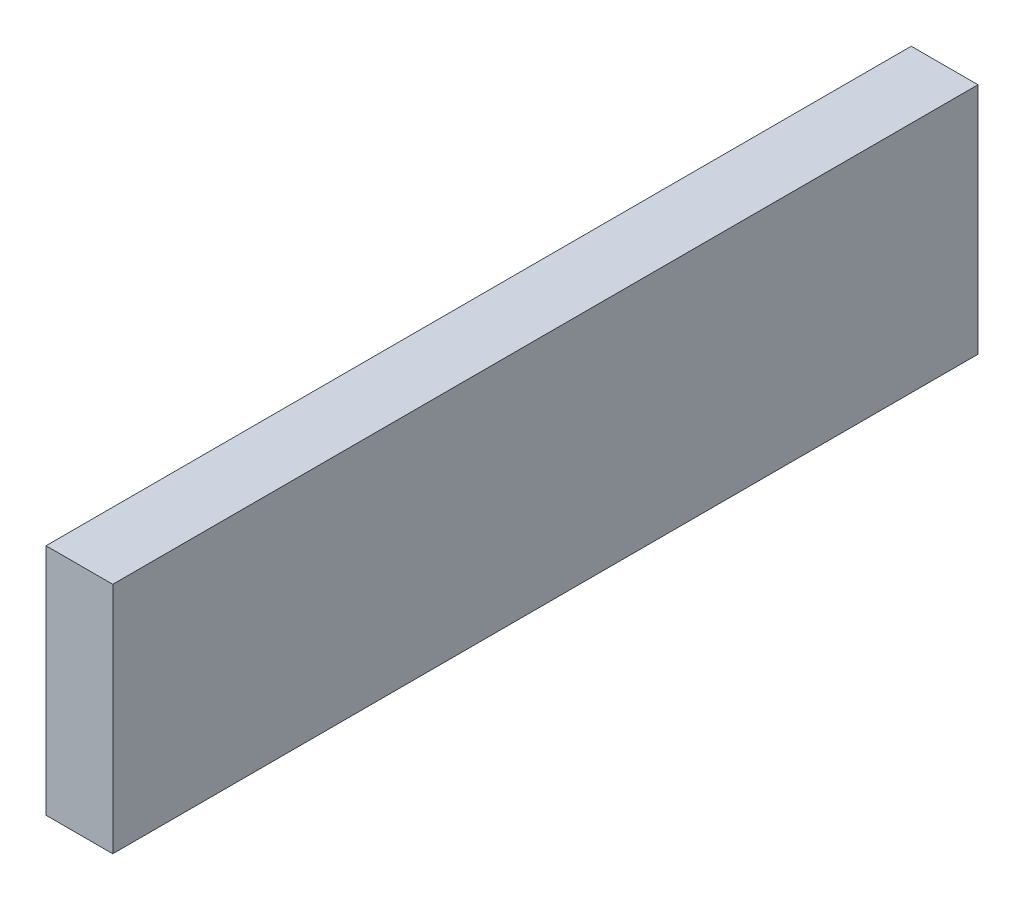
ISO-10303-21;
HEADER;
FILE_DESCRIPTION(('STEP AP214'),'2;1');
FILE_NAME('part.step','',(''),(''),'','','');
FILE_SCHEMA(('AUTOMOTIVE_DESIGN { 1 0 10303 214 1 1 1 1 }'));
ENDSEC;
DATA;
#1=APPLICATION_CONTEXT('core data for automotive mechanical design processes');
#2=APPLICATION_PROTOCOL_DEFINITION('international standard','automotive_design',2000,#1);
#3=PRODUCT_CONTEXT('',#1,'mechanical');
#4=PRODUCT('Part','Part','',(#3));
#5=PRODUCT_RELATED_PRODUCT_CATEGORY('part','',(#4));
#6=PRODUCT_DEFINITION_FORMATION('','',#4);
#7=PRODUCT_DEFINITION_CONTEXT('part definition',#1,'design');
#8=PRODUCT_DEFINITION('design','',#6,#7);
#9=PRODUCT_DEFINITION_SHAPE('','',#8);
#10=(LENGTH_UNIT() NAMED_UNIT(*) SI_UNIT(.MILLI.,.METRE.));
#11=(NAMED_UNIT(*) PLANE_ANGLE_UNIT() SI_UNIT($,.RADIAN.));
#12=(NAMED_UNIT(*) SI_UNIT($,.STERADIAN.) SOLID_ANGLE_UNIT());
#13=UNCERTAINTY_MEASURE_WITH_UNIT(LENGTH_MEASURE(1.E-05),#10,'distance_accuracy_value','');
#14=(GEOMETRIC_REPRESENTATION_CONTEXT(3) GLOBAL_UNCERTAINTY_ASSIGNED_CONTEXT((#13)) GLOBAL_UNIT_ASSIGNED_CONTEXT((#10,
#11,#12)) REPRESENTATION_CONTEXT('',''));
#15=CARTESIAN_POINT('',(0.,0.,0.));
#16=DIRECTION('',(0.,0.,1.));
#17=DIRECTION('',(1.,0.,0.));
#18=AXIS2_PLACEMENT_3D('',#15,#16,#17);
#19=CARTESIAN_POINT('',(1.25,17.8,0.));
#20=DIRECTION('',(0.,0.,-1.));
#21=DIRECTION('',(0.,1.,0.));
#22=AXIS2_PLACEMENT_3D('',#19,#20,#21);
#23=PLANE('',#22);
#24=DIRECTION('',(0.,-1.,0.));
#25=VECTOR('',#24,1.);
#26=CARTESIAN_POINT('',(1.25,17.8,0.));
#27=LINE('',#26,#25);
#28=CARTESIAN_POINT('',(1.25,4.37,0.));
#29=VERTEX_POINT('',#28);
#30=CARTESIAN_POINT('',(1.25,0.,0.));
#31=VERTEX_POINT('',#30);
#32=EDGE_CURVE('E86',#29,#31,#27,.T.);
#33=ORIENTED_EDGE('',*,*,#32,.F.);
#34=DIRECTION('',(1.,0.,0.));
#35=VECTOR('',#34,1.);
#36=CARTESIAN_POINT('',(0.,4.37,0.));
#37=LINE('',#36,#35);
#38=CARTESIAN_POINT('',(0.,4.37,0.));
#39=VERTEX_POINT('',#38);
#40=EDGE_CURVE('E94',#39,#29,#37,.T.);
#41=ORIENTED_EDGE('',*,*,#40,.F.);
#42=DIRECTION('',(0.,-1.,0.));
#43=VECTOR('',#42,1.);
#44=CARTESIAN_POINT('',(0.,17.8,0.));
#45=LINE('',#44,#43);
#46=CARTESIAN_POINT('',(0.,0.,0.));
#47=VERTEX_POINT('',#46);
#48=EDGE_CURVE('E61',#39,#47,#45,.T.);
#49=ORIENTED_EDGE('',*,*,#48,.T.);
#50=DIRECTION('',(-1.,0.,0.));
#51=VECTOR('',#50,1.);
#52=CARTESIAN_POINT('',(1.25,0.,0.));
#53=LINE('',#52,#51);
#54=EDGE_CURVE('E11',#31,#47,#53,.T.);
#55=ORIENTED_EDGE('',*,*,#54,.F.);
#56=EDGE_LOOP('',(#33,#41,#49,#55));
#57=FACE_BOUND('',#56,.T.);
#58=ADVANCED_FACE('F34',(#57),#23,.F.);
#59=CARTESIAN_POINT('',(1.25,0.,0.));
#60=DIRECTION('',(0.,1.,0.));
#61=DIRECTION('',(0.,0.,1.));
#62=AXIS2_PLACEMENT_3D('',#59,#60,#61);
#63=PLANE('',#62);
#64=DIRECTION('',(0.,0.,-1.));
#65=VECTOR('',#64,1.);
#66=CARTESIAN_POINT('',(0.,0.,0.));
#67=LINE('',#66,#65);
#68=CARTESIAN_POINT('',(0.,0.,-16.2));
#69=VERTEX_POINT('',#68);
#70=EDGE_CURVE('E87',#47,#69,#67,.T.);
#71=ORIENTED_EDGE('',*,*,#70,.T.);
#72=DIRECTION('',(-1.,0.,0.));
#73=VECTOR('',#72,1.);
#74=CARTESIAN_POINT('',(1.25,0.,-16.2));
#75=LINE('',#74,#73);
#76=CARTESIAN_POINT('',(1.25,0.,-16.2));
#77=VERTEX_POINT('',#76);
#78=EDGE_CURVE('E42',#77,#69,#75,.T.);
#79=ORIENTED_EDGE('',*,*,#78,.F.);
#80=DIRECTION('',(0.,0.,-1.));
#81=VECTOR('',#80,1.);
#82=CARTESIAN_POINT('',(1.25,0.,0.));
#83=LINE('',#82,#81);
#84=EDGE_CURVE('E50',#31,#77,#83,.T.);
#85=ORIENTED_EDGE('',*,*,#84,.F.);
#86=ORIENTED_EDGE('',*,*,#54,.T.);
#87=EDGE_LOOP('',(#71,#79,#85,#86));
#88=FACE_BOUND('',#87,.T.);
#89=ADVANCED_FACE('F107',(#88),#63,.F.);
#90=CARTESIAN_POINT('',(1.25,0.,-16.2));
#91=DIRECTION('',(0.,0.,1.));
#92=DIRECTION('',(1.,0.,0.));
#93=AXIS2_PLACEMENT_3D('',#90,#91,#92);
#94=PLANE('',#93);
#95=DIRECTION('',(0.,1.,0.));
#96=VECTOR('',#95,1.);
#97=CARTESIAN_POINT('',(0.,0.,-16.2));
#98=LINE('',#97,#96);
#99=CARTESIAN_POINT('',(0.,4.37,-16.2));
#100=VERTEX_POINT('',#99);
#101=EDGE_CURVE('E80',#69,#100,#98,.T.);
#102=ORIENTED_EDGE('',*,*,#101,.T.);
#103=DIRECTION('',(-1.,0.,0.));
#104=VECTOR('',#103,1.);
#105=CARTESIAN_POINT('',(1.25,4.37,-16.2));
#106=LINE('',#105,#104);
#107=CARTESIAN_POINT('',(1.25,4.37,-16.2));
#108=VERTEX_POINT('',#107);
#109=EDGE_CURVE('E84',#108,#100,#106,.T.);
#110=ORIENTED_EDGE('',*,*,#109,.F.);
#111=DIRECTION('',(0.,1.,0.));
#112=VECTOR('',#111,1.);
#113=CARTESIAN_POINT('',(1.25,0.,-16.2));
#114=LINE('',#113,#112);
#115=EDGE_CURVE('E67',#77,#108,#114,.T.);
#116=ORIENTED_EDGE('',*,*,#115,.F.);
#117=ORIENTED_EDGE('',*,*,#78,.T.);
#118=EDGE_LOOP('',(#102,#110,#116,#117));
#119=FACE_BOUND('',#118,.T.);
#120=ADVANCED_FACE('F82',(#119),#94,.F.);
#121=CARTESIAN_POINT('',(1.25,0.,0.));
#122=DIRECTION('',(1.,0.,0.));
#123=DIRECTION('',(0.,0.,-1.));
#124=AXIS2_PLACEMENT_3D('',#121,#122,#123);
#125=PLANE('',#124);
#126=ORIENTED_EDGE('',*,*,#115,.T.);
#127=DIRECTION('',(0.,0.,-1.));
#128=VECTOR('',#127,1.);
#129=CARTESIAN_POINT('',(1.25,4.37,0.));
#130=LINE('',#129,#128);
#131=EDGE_CURVE('E97',#29,#108,#130,.T.);
#132=ORIENTED_EDGE('',*,*,#131,.F.);
#133=ORIENTED_EDGE('',*,*,#32,.T.);
#134=ORIENTED_EDGE('',*,*,#84,.T.);
#135=EDGE_LOOP('',(#126,#132,#133,#134));
#136=FACE_BOUND('',#135,.T.);
#137=ADVANCED_FACE('F108',(#136),#125,.T.);
#138=CARTESIAN_POINT('',(0.,0.,0.));
#139=DIRECTION('',(1.,0.,0.));
#140=DIRECTION('',(0.,0.,-1.));
#141=AXIS2_PLACEMENT_3D('',#138,#139,#140);
#142=PLANE('',#141);
#143=ORIENTED_EDGE('',*,*,#48,.F.);
#144=DIRECTION('',(0.,0.,1.));
#145=VECTOR('',#144,1.);
#146=CARTESIAN_POINT('',(0.,4.37,-16.2));
#147=LINE('',#146,#145);
#148=EDGE_CURVE('E90',#100,#39,#147,.T.);
#149=ORIENTED_EDGE('',*,*,#148,.F.);
#150=ORIENTED_EDGE('',*,*,#101,.F.);
#151=ORIENTED_EDGE('',*,*,#70,.F.);
#152=EDGE_LOOP('',(#143,#149,#150,#151));
#153=FACE_BOUND('',#152,.T.);
#154=ADVANCED_FACE('F91',(#153),#142,.F.);
#155=CARTESIAN_POINT('',(0.,4.37,0.));
#156=DIRECTION('',(0.,1.,0.));
#157=DIRECTION('',(0.,0.,1.));
#158=AXIS2_PLACEMENT_3D('',#155,#156,#157);
#159=PLANE('',#158);
#160=ORIENTED_EDGE('',*,*,#109,.T.);
#161=ORIENTED_EDGE('',*,*,#148,.T.);
#162=ORIENTED_EDGE('',*,*,#40,.T.);
#163=ORIENTED_EDGE('',*,*,#131,.T.);
#164=EDGE_LOOP('',(#160,#161,#162,#163));
#165=FACE_BOUND('',#164,.T.);
#166=ADVANCED_FACE('F96',(#165),#159,.T.);
#167=CLOSED_SHELL('',(#58,#89,#120,#137,#154,#166));
#168=MANIFOLD_SOLID_BREP('B2',#167);
#169=ADVANCED_BREP_SHAPE_REPRESENTATION('',(#18,#168),#14);
#170=SHAPE_DEFINITION_REPRESENTATION(#9,#169);
ENDSEC;
END-ISO-10303-21;
